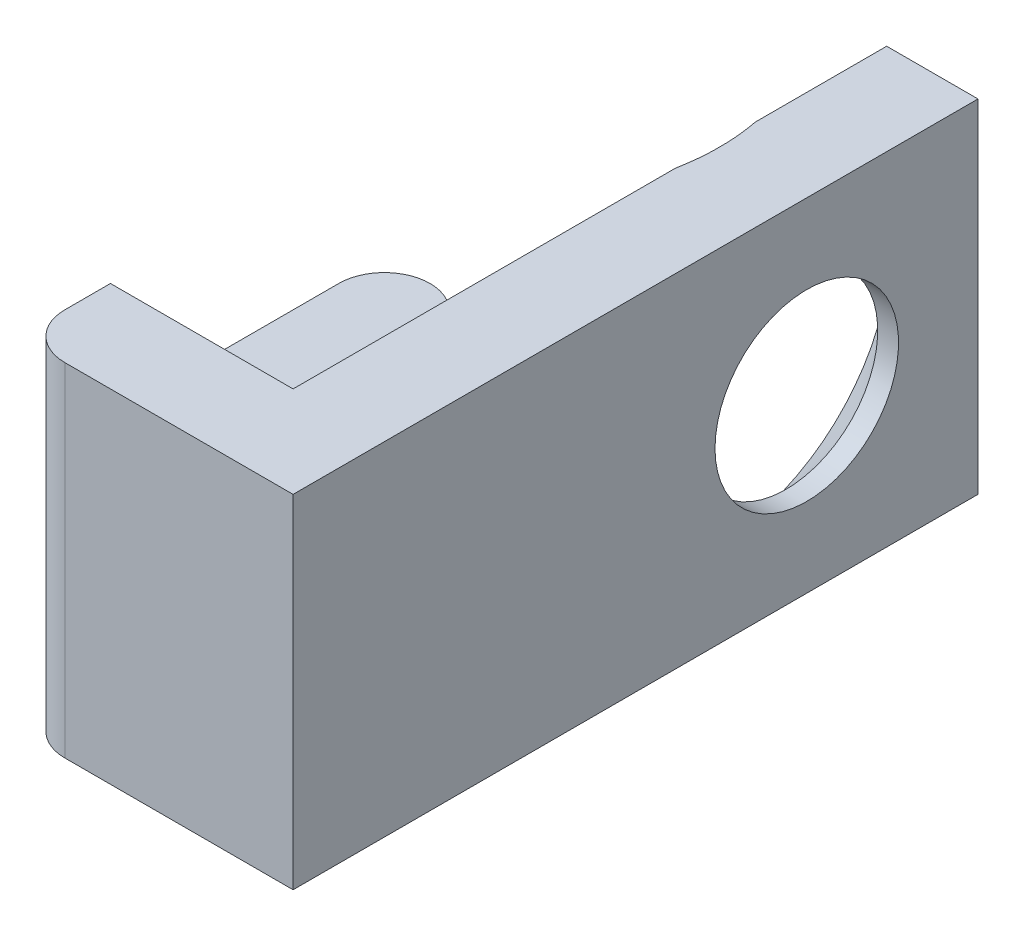
ISO-10303-21;
HEADER;
FILE_DESCRIPTION(('STEP AP214'),'2;1');
FILE_NAME('part.step','',(''),(''),'','','');
FILE_SCHEMA(('AUTOMOTIVE_DESIGN { 1 0 10303 214 1 1 1 1 }'));
ENDSEC;
DATA;
#1=APPLICATION_CONTEXT('core data for automotive mechanical design processes');
#2=APPLICATION_PROTOCOL_DEFINITION('international standard','automotive_design',2000,#1);
#3=PRODUCT_CONTEXT('',#1,'mechanical');
#4=PRODUCT('Part','Part','',(#3));
#5=PRODUCT_RELATED_PRODUCT_CATEGORY('part','',(#4));
#6=PRODUCT_DEFINITION_FORMATION('','',#4);
#7=PRODUCT_DEFINITION_CONTEXT('part definition',#1,'design');
#8=PRODUCT_DEFINITION('design','',#6,#7);
#9=PRODUCT_DEFINITION_SHAPE('','',#8);
#10=(LENGTH_UNIT() NAMED_UNIT(*) SI_UNIT(.MILLI.,.METRE.));
#11=(NAMED_UNIT(*) PLANE_ANGLE_UNIT() SI_UNIT($,.RADIAN.));
#12=(NAMED_UNIT(*) SI_UNIT($,.STERADIAN.) SOLID_ANGLE_UNIT());
#13=UNCERTAINTY_MEASURE_WITH_UNIT(LENGTH_MEASURE(1.E-05),#10,'distance_accuracy_value','');
#14=(GEOMETRIC_REPRESENTATION_CONTEXT(3) GLOBAL_UNCERTAINTY_ASSIGNED_CONTEXT((#13)) GLOBAL_UNIT_ASSIGNED_CONTEXT((#10,
#11,#12)) REPRESENTATION_CONTEXT('',''));
#15=CARTESIAN_POINT('',(0.,0.,0.));
#16=DIRECTION('',(0.,0.,1.));
#17=DIRECTION('',(1.,0.,0.));
#18=AXIS2_PLACEMENT_3D('',#15,#16,#17);
#19=CARTESIAN_POINT('',(-6.35,4.7625,0.));
#20=DIRECTION('',(-1.,0.,0.));
#21=DIRECTION('',(0.,0.,1.));
#22=AXIS2_PLACEMENT_3D('',#19,#20,#21);
#23=PLANE('',#22);
#24=DIRECTION('',(0.,0.,-1.));
#25=VECTOR('',#24,1.);
#26=CARTESIAN_POINT('',(-6.35,-1.5875,0.));
#27=LINE('',#26,#25);
#28=CARTESIAN_POINT('',(-6.35,-1.5875,3.81));
#29=VERTEX_POINT('',#28);
#30=CARTESIAN_POINT('',(-6.35,-1.5875,0.634999999999999));
#31=VERTEX_POINT('',#30);
#32=EDGE_CURVE('E151',#29,#31,#27,.T.);
#33=ORIENTED_EDGE('',*,*,#32,.F.);
#34=CARTESIAN_POINT('',(-6.35,-4.7625,3.81));
#35=DIRECTION('',(-1.,0.,0.));
#36=DIRECTION('',(0.,0.,1.));
#37=AXIS2_PLACEMENT_3D('',#34,#35,#36);
#38=CIRCLE('',#37,3.175);
#39=CARTESIAN_POINT('',(-6.35,-4.7625,6.98499999999999));
#40=VERTEX_POINT('',#39);
#41=EDGE_CURVE('E141',#40,#29,#38,.T.);
#42=ORIENTED_EDGE('',*,*,#41,.F.);
#43=DIRECTION('',(0.,0.,-1.));
#44=VECTOR('',#43,1.);
#45=CARTESIAN_POINT('',(-6.35,-4.7625,0.));
#46=LINE('',#45,#44);
#47=CARTESIAN_POINT('',(-6.35,-4.7625,8.255));
#48=VERTEX_POINT('',#47);
#49=EDGE_CURVE('E273',#48,#40,#46,.T.);
#50=ORIENTED_EDGE('',*,*,#49,.F.);
#51=DIRECTION('',(0.,-1.,0.));
#52=VECTOR('',#51,1.);
#53=CARTESIAN_POINT('',(-6.35,4.7625,8.255));
#54=LINE('',#53,#52);
#55=CARTESIAN_POINT('',(-6.35,4.7625,8.255));
#56=VERTEX_POINT('',#55);
#57=EDGE_CURVE('E231',#56,#48,#54,.T.);
#58=ORIENTED_EDGE('',*,*,#57,.F.);
#59=DIRECTION('',(0.,0.,-1.));
#60=VECTOR('',#59,1.);
#61=CARTESIAN_POINT('',(-6.35,4.7625,0.));
#62=LINE('',#61,#60);
#63=CARTESIAN_POINT('',(-6.35,4.7625,6.985));
#64=VERTEX_POINT('',#63);
#65=EDGE_CURVE('E256',#56,#64,#62,.T.);
#66=ORIENTED_EDGE('',*,*,#65,.T.);
#67=CARTESIAN_POINT('',(-6.35,4.7625,3.81));
#68=DIRECTION('',(-1.,0.,0.));
#69=DIRECTION('',(0.,0.,1.));
#70=AXIS2_PLACEMENT_3D('',#67,#68,#69);
#71=CIRCLE('',#70,3.175);
#72=CARTESIAN_POINT('',(-6.35,1.5875,3.81));
#73=VERTEX_POINT('',#72);
#74=EDGE_CURVE('E49',#73,#64,#71,.T.);
#75=ORIENTED_EDGE('',*,*,#74,.F.);
#76=DIRECTION('',(0.,0.,1.));
#77=VECTOR('',#76,1.);
#78=CARTESIAN_POINT('',(-6.35,1.5875,0.));
#79=LINE('',#78,#77);
#80=CARTESIAN_POINT('',(-6.35,1.5875,0.634999999999999));
#81=VERTEX_POINT('',#80);
#82=EDGE_CURVE('E168',#81,#73,#79,.T.);
#83=ORIENTED_EDGE('',*,*,#82,.F.);
#84=DIRECTION('',(0.,-1.,0.));
#85=VECTOR('',#84,1.);
#86=CARTESIAN_POINT('',(-6.35,4.7625,0.634999999999999));
#87=LINE('',#86,#85);
#88=EDGE_CURVE('E164',#81,#31,#87,.T.);
#89=ORIENTED_EDGE('',*,*,#88,.T.);
#90=EDGE_LOOP('',(#33,#42,#50,#58,#66,#75,#83,#89));
#91=FACE_BOUND('',#90,.T.);
#92=ADVANCED_FACE('F35',(#91),#23,.T.);
#93=CARTESIAN_POINT('',(-3.81,4.7625,0.));
#94=DIRECTION('',(-1.,0.,0.));
#95=DIRECTION('',(0.,0.,1.));
#96=AXIS2_PLACEMENT_3D('',#93,#94,#95);
#97=PLANE('',#96);
#98=CARTESIAN_POINT('',(-3.81,-4.7625,3.81));
#99=DIRECTION('',(-1.,0.,0.));
#100=DIRECTION('',(0.,0.,1.));
#101=AXIS2_PLACEMENT_3D('',#98,#99,#100);
#102=CIRCLE('',#101,3.175);
#103=CARTESIAN_POINT('',(-3.81,-1.5875,3.81));
#104=VERTEX_POINT('',#103);
#105=CARTESIAN_POINT('',(-3.81,-4.7625,6.985));
#106=VERTEX_POINT('',#105);
#107=EDGE_CURVE('E178',#104,#106,#102,.F.);
#108=ORIENTED_EDGE('',*,*,#107,.F.);
#109=DIRECTION('',(0.,0.,1.));
#110=VECTOR('',#109,1.);
#111=CARTESIAN_POINT('',(-3.81,-1.5875,0.));
#112=LINE('',#111,#110);
#113=CARTESIAN_POINT('',(-3.81,-1.5875,0.634999999999999));
#114=VERTEX_POINT('',#113);
#115=EDGE_CURVE('E159',#114,#104,#112,.T.);
#116=ORIENTED_EDGE('',*,*,#115,.F.);
#117=DIRECTION('',(0.,-1.,0.));
#118=VECTOR('',#117,1.);
#119=CARTESIAN_POINT('',(-3.81,4.7625,0.634999999999999));
#120=LINE('',#119,#118);
#121=CARTESIAN_POINT('',(-3.81,1.5875,0.634999999999999));
#122=VERTEX_POINT('',#121);
#123=EDGE_CURVE('E248',#122,#114,#120,.T.);
#124=ORIENTED_EDGE('',*,*,#123,.F.);
#125=DIRECTION('',(0.,0.,-1.));
#126=VECTOR('',#125,1.);
#127=CARTESIAN_POINT('',(-3.81,1.5875,0.));
#128=LINE('',#127,#126);
#129=CARTESIAN_POINT('',(-3.81,1.5875,3.81));
#130=VERTEX_POINT('',#129);
#131=EDGE_CURVE('E173',#130,#122,#128,.T.);
#132=ORIENTED_EDGE('',*,*,#131,.F.);
#133=CARTESIAN_POINT('',(-3.81,4.7625,3.81));
#134=DIRECTION('',(-1.,0.,0.));
#135=DIRECTION('',(0.,0.,1.));
#136=AXIS2_PLACEMENT_3D('',#133,#134,#135);
#137=CIRCLE('',#136,3.175);
#138=CARTESIAN_POINT('',(-3.81,4.7625,6.985));
#139=VERTEX_POINT('',#138);
#140=EDGE_CURVE('E180',#139,#130,#137,.F.);
#141=ORIENTED_EDGE('',*,*,#140,.F.);
#142=DIRECTION('',(0.,-1.,0.));
#143=VECTOR('',#142,1.);
#144=CARTESIAN_POINT('',(-3.81,4.7625,6.985));
#145=LINE('',#144,#143);
#146=EDGE_CURVE('E245',#139,#106,#145,.T.);
#147=ORIENTED_EDGE('',*,*,#146,.T.);
#148=EDGE_LOOP('',(#108,#116,#124,#132,#141,#147));
#149=FACE_BOUND('',#148,.T.);
#150=ADVANCED_FACE('F302',(#149),#97,.F.);
#151=CARTESIAN_POINT('',(-5.08,4.7625,0.634999999999999));
#152=DIRECTION('',(0.,-1.,0.));
#153=DIRECTION('',(0.,0.,-1.));
#154=AXIS2_PLACEMENT_3D('',#151,#152,#153);
#155=CYLINDRICAL_SURFACE('',#154,1.27);
#156=CARTESIAN_POINT('',(-5.08,-1.5875,0.634999999999999));
#157=DIRECTION('',(0.,-1.,0.));
#158=DIRECTION('',(0.,0.,-1.));
#159=AXIS2_PLACEMENT_3D('',#156,#157,#158);
#160=CIRCLE('',#159,1.27);
#161=EDGE_CURVE('E175',#31,#114,#160,.T.);
#162=ORIENTED_EDGE('',*,*,#161,.F.);
#163=ORIENTED_EDGE('',*,*,#88,.F.);
#164=CARTESIAN_POINT('',(-5.08,1.5875,0.634999999999999));
#165=DIRECTION('',(0.,1.,0.));
#166=DIRECTION('',(0.,0.,1.));
#167=AXIS2_PLACEMENT_3D('',#164,#165,#166);
#168=CIRCLE('',#167,1.27);
#169=EDGE_CURVE('E160',#122,#81,#168,.T.);
#170=ORIENTED_EDGE('',*,*,#169,.F.);
#171=ORIENTED_EDGE('',*,*,#123,.T.);
#172=EDGE_LOOP('',(#162,#163,#170,#171));
#173=FACE_BOUND('',#172,.T.);
#174=ADVANCED_FACE('F215',(#173),#155,.T.);
#175=CARTESIAN_POINT('',(0.,4.7625,0.));
#176=DIRECTION('',(0.,1.,0.));
#177=DIRECTION('',(0.,0.,1.));
#178=AXIS2_PLACEMENT_3D('',#175,#176,#177);
#179=PLANE('',#178);
#180=DIRECTION('',(-1.,0.,0.));
#181=VECTOR('',#180,1.);
#182=CARTESIAN_POINT('',(0.,4.7625,6.985));
#183=LINE('',#182,#181);
#184=CARTESIAN_POINT('',(-1.27,4.7625,6.985));
#185=VERTEX_POINT('',#184);
#186=EDGE_CURVE('E252',#185,#139,#183,.T.);
#187=ORIENTED_EDGE('',*,*,#186,.T.);
#188=DIRECTION('',(1.,0.,0.));
#189=VECTOR('',#188,1.);
#190=CARTESIAN_POINT('',(-6.35,4.7625,6.985));
#191=LINE('',#190,#189);
#192=EDGE_CURVE('E11',#139,#64,#191,.F.);
#193=ORIENTED_EDGE('',*,*,#192,.T.);
#194=ORIENTED_EDGE('',*,*,#65,.F.);
#195=CARTESIAN_POINT('',(-5.08,4.7625,8.255));
#196=DIRECTION('',(0.,1.,0.));
#197=DIRECTION('',(0.,0.,1.));
#198=AXIS2_PLACEMENT_3D('',#195,#196,#197);
#199=CIRCLE('',#198,1.27);
#200=CARTESIAN_POINT('',(-5.08,4.7625,9.525));
#201=VERTEX_POINT('',#200);
#202=EDGE_CURVE('E289',#56,#201,#199,.T.);
#203=ORIENTED_EDGE('',*,*,#202,.T.);
#204=DIRECTION('',(-1.,0.,0.));
#205=VECTOR('',#204,1.);
#206=CARTESIAN_POINT('',(0.,4.7625,9.525));
#207=LINE('',#206,#205);
#208=CARTESIAN_POINT('',(1.27,4.7625,9.525));
#209=VERTEX_POINT('',#208);
#210=EDGE_CURVE('E286',#209,#201,#207,.T.);
#211=ORIENTED_EDGE('',*,*,#210,.F.);
#212=DIRECTION('',(0.,0.,-1.));
#213=VECTOR('',#212,1.);
#214=CARTESIAN_POINT('',(1.27,4.7625,0.));
#215=LINE('',#214,#213);
#216=CARTESIAN_POINT('',(1.27,4.7625,-9.525));
#217=VERTEX_POINT('',#216);
#218=EDGE_CURVE('E284',#209,#217,#215,.T.);
#219=ORIENTED_EDGE('',*,*,#218,.T.);
#220=DIRECTION('',(1.,0.,0.));
#221=VECTOR('',#220,1.);
#222=CARTESIAN_POINT('',(0.,4.7625,-9.525));
#223=LINE('',#222,#221);
#224=CARTESIAN_POINT('',(-1.27,4.7625,-9.525));
#225=VERTEX_POINT('',#224);
#226=EDGE_CURVE('E281',#225,#217,#223,.T.);
#227=ORIENTED_EDGE('',*,*,#226,.F.);
#228=DIRECTION('',(0.,0.,-1.));
#229=VECTOR('',#228,1.);
#230=CARTESIAN_POINT('',(-1.27,4.7625,0.));
#231=LINE('',#230,#229);
#232=CARTESIAN_POINT('',(-1.27,4.7625,-5.86966033165933));
#233=VERTEX_POINT('',#232);
#234=EDGE_CURVE('E280',#233,#225,#231,.T.);
#235=ORIENTED_EDGE('',*,*,#234,.F.);
#236=CARTESIAN_POINT('',(-5.62698198970123,4.7625,-13.6486852423024));
#237=CARTESIAN_POINT('',(-5.48405181043274,4.7625,-13.4554022025235));
#238=CARTESIAN_POINT('',(-5.34177027240464,4.7625,-13.261635486537));
#239=CARTESIAN_POINT('',(-5.05881023652339,4.7625,-12.87291597153));
#240=CARTESIAN_POINT('',(-4.91813184619668,4.7625,-12.6779630942807));
#241=CARTESIAN_POINT('',(-4.63837640303074,4.7625,-12.2862209008152));
#242=CARTESIAN_POINT('',(-4.49930386235509,4.7625,-12.08942835697));
#243=CARTESIAN_POINT('',(-4.22353144435932,4.7625,-11.6941920870384));
#244=CARTESIAN_POINT('',(-4.08683151221835,4.7625,-11.49574839926));
#245=CARTESIAN_POINT('',(-3.81014565709836,4.7625,-11.087709994364));
#246=CARTESIAN_POINT('',(-3.67029725258007,4.7625,-10.8780217911883));
#247=CARTESIAN_POINT('',(-3.39466094259247,4.7625,-10.4559954922825));
#248=CARTESIAN_POINT('',(-3.2588728940184,4.7625,-10.2436574903177));
#249=CARTESIAN_POINT('',(-2.99263886077864,4.7625,-9.8159080888331));
#250=CARTESIAN_POINT('',(-2.86218819856629,4.7625,-9.60049961359343));
#251=CARTESIAN_POINT('',(-2.60813506619638,4.7625,-9.16569848540146));
#252=CARTESIAN_POINT('',(-2.48453160975527,4.7625,-8.94630641233006));
#253=CARTESIAN_POINT('',(-2.24478535240492,4.7625,-8.49955565581558));
#254=CARTESIAN_POINT('',(-2.12876814798659,4.7625,-8.27212897398496));
#255=CARTESIAN_POINT('',(-1.90935858859765,4.7625,-7.81104716494044));
#256=CARTESIAN_POINT('',(-1.80597219322786,4.7625,-7.57738916045719));
#257=CARTESIAN_POINT('',(-1.61758040331887,4.7625,-7.10572150369547));
#258=CARTESIAN_POINT('',(-1.53238097455184,4.7625,-6.86779057911233));
#259=CARTESIAN_POINT('',(-1.38480361925059,4.7625,-6.38505263199183));
#260=CARTESIAN_POINT('',(-1.32239315527715,4.7625,-6.14025595456541));
#261=CARTESIAN_POINT('',(-1.25282511829775,4.7625,-5.78125818246457));
#262=CARTESIAN_POINT('',(-1.23415415302169,4.7625,-5.66924459439971));
#263=CARTESIAN_POINT('',(-1.20309477945248,4.7625,-5.44423157526996));
#264=CARTESIAN_POINT('',(-1.19071243901943,4.7625,-5.33123129866222));
#265=CARTESIAN_POINT('',(-1.16869712968132,4.7625,-5.05553291027898));
#266=CARTESIAN_POINT('',(-1.16258624535323,4.7625,-4.89253792353511));
#267=CARTESIAN_POINT('',(-1.16447359624844,4.7625,-4.56658583975173));
#268=CARTESIAN_POINT('',(-1.17247673413935,4.7625,-4.40362877555097));
#269=CARTESIAN_POINT('',(-1.20213539760851,4.7625,-4.07870525763733));
#270=CARTESIAN_POINT('',(-1.22381361625543,4.7625,-3.91674090324772));
#271=CARTESIAN_POINT('',(-1.2796360783885,4.7625,-3.59500618312683));
#272=CARTESIAN_POINT('',(-1.31378129683157,4.7625,-3.4352359899998));
#273=CARTESIAN_POINT('',(-1.41921824852125,4.7625,-3.01329133618839));
#274=CARTESIAN_POINT('',(-1.50012384032314,4.7625,-2.75352142821305));
#275=CARTESIAN_POINT('',(-1.68438394329689,4.7625,-2.24206612171954));
#276=CARTESIAN_POINT('',(-1.78775985341801,4.7625,-1.99038869391853));
#277=CARTESIAN_POINT('',(-1.95560415867418,4.7625,-1.6169148934159));
#278=CARTESIAN_POINT('',(-2.01407369633418,4.7625,-1.49236009071142));
#279=CARTESIAN_POINT('',(-2.1345430727819,4.7625,-1.24496423573852));
#280=CARTESIAN_POINT('',(-2.19654295939915,4.7625,-1.12212320671656));
#281=CARTESIAN_POINT('',(-2.32349707110234,4.7625,-0.878058265791833));
#282=CARTESIAN_POINT('',(-2.38844988827291,4.7625,-0.756833618148688));
#283=CARTESIAN_POINT('',(-2.52089293725942,4.7625,-0.515788704648179));
#284=CARTESIAN_POINT('',(-2.58838305421762,4.7625,-0.395968375541849));
#285=CARTESIAN_POINT('',(-2.74356164138738,4.7625,-0.126239517105304));
#286=CARTESIAN_POINT('',(-2.83189545136506,4.7625,0.0232973633632844));
#287=CARTESIAN_POINT('',(-3.01142585785314,4.7625,0.320645687364755));
#288=CARTESIAN_POINT('',(-3.10262258595299,4.7625,0.46845705115739));
#289=CARTESIAN_POINT('',(-3.37979909692249,4.7625,0.909708657485873));
#290=CARTESIAN_POINT('',(-3.56933520410123,4.7625,1.2009150502478));
#291=CARTESIAN_POINT('',(-3.9552531746,4.7625,1.77904180766329));
#292=CARTESIAN_POINT('',(-4.15164017016247,4.7625,2.0659587186376));
#293=CARTESIAN_POINT('',(-4.54933148040171,4.7625,2.63631602475295));
#294=CARTESIAN_POINT('',(-4.75063533442816,4.7625,2.9197567418624));
#295=CARTESIAN_POINT('',(-5.15756712088544,4.7625,3.4848072655965));
#296=CARTESIAN_POINT('',(-5.36320625275508,4.7625,3.76640898431573));
#297=CARTESIAN_POINT('',(-5.77736481023725,4.7625,4.32749168311601));
#298=CARTESIAN_POINT('',(-5.98588429396599,4.7625,4.60697262022975));
#299=CARTESIAN_POINT('',(-6.4050887655197,4.7625,5.1641107257231));
#300=CARTESIAN_POINT('',(-6.61577275905452,4.7625,5.44176864319153));
#301=CARTESIAN_POINT('',(-7.03894684204349,4.7625,5.99570552027054));
#302=CARTESIAN_POINT('',(-7.25143694064792,4.7625,6.27198447288359));
#303=CARTESIAN_POINT('',(-7.84189180322821,4.7625,7.03551206601694));
#304=CARTESIAN_POINT('',(-8.22140711635939,4.7625,7.52156128126648));
#305=CARTESIAN_POINT('',(-8.98372114767731,4.7625,8.49117286270808));
#306=CARTESIAN_POINT('',(-9.36652027825423,4.7625,8.97473490398656));
#307=CARTESIAN_POINT('',(-10.1323342488149,4.7625,9.93723096070064));
#308=CARTESIAN_POINT('',(-10.5153356402058,4.7625,10.4161756861426));
#309=CARTESIAN_POINT('',(-11.2831073564794,4.7625,11.372529504489));
#310=CARTESIAN_POINT('',(-11.6678774119547,4.7625,11.8499388135956));
#311=CARTESIAN_POINT('',(-12.0532933052755,4.7625,12.3268225876999));
#312=B_SPLINE_CURVE_WITH_KNOTS('',3,(#236,#237,#238,#239,#240,#241,#242,#243,#244,#245,#246,
#247,#248,#249,#250,#251,#252,#253,#254,#255,#256,#257,#258,#259,#260,#261,#262,#263,#264,#265,
#266,#267,#268,#269,#270,#271,#272,#273,#274,#275,#276,#277,#278,#279,#280,#281,#282,#283,#284,
#285,#286,#287,#288,#289,#290,#291,#292,#293,#294,#295,#296,#297,#298,#299,#300,#301,#302,#303,
#304,#305,#306,#307,#308,#309,#310,#311),.UNSPECIFIED.,.F.,.F.,(4,2,2,2,2,2,2,2,2,2,2,2,2,2,2,2,
2,2,2,2,2,2,2,2,2,2,2,2,2,2,2,2,2,2,2,2,2,4),(0.,0.721173556627895,1.44239520249632,
2.16530282645291,2.88819372480881,3.64429219766824,4.40036399081446,5.1557583332225,
5.9110435828587,6.67668921501423,7.44269471825649,8.20006677850676,8.95635321655771,
9.29687807866844,9.63773089008886,10.1264271621834,10.6152932219743,11.1049726707701,
11.5946904221786,12.4093975128991,13.224883892066,13.6376267337424,14.0503751686321,
14.4629288335209,14.875463845484,15.3964578930329,15.9174759224032,16.9596903412745,
18.0027030335387,19.0456183800991,20.091675514682,21.1377537862388,22.1833712939712,
23.2289941022834,25.0789672057981,26.9291761376476,28.768927344376,30.6084070342245),.UNSPECIFIED.);
#313=CARTESIAN_POINT('',(-1.27,4.7625,-3.65533966834068));
#314=VERTEX_POINT('',#313);
#315=EDGE_CURVE('E191',#314,#233,#312,.F.);
#316=ORIENTED_EDGE('',*,*,#315,.F.);
#317=EDGE_CURVE('E277',#185,#314,#231,.T.);
#318=ORIENTED_EDGE('',*,*,#317,.F.);
#319=EDGE_LOOP('',(#187,#193,#194,#203,#211,#219,#227,#235,#316,#318));
#320=FACE_BOUND('',#319,.T.);
#321=ADVANCED_FACE('F210',(#320),#179,.T.);
#322=CARTESIAN_POINT('',(0.,-4.7625,0.));
#323=DIRECTION('',(0.,1.,0.));
#324=DIRECTION('',(0.,0.,1.));
#325=AXIS2_PLACEMENT_3D('',#322,#323,#324);
#326=PLANE('',#325);
#327=DIRECTION('',(1.,0.,0.));
#328=VECTOR('',#327,1.);
#329=CARTESIAN_POINT('',(-6.35,-4.7625,6.98499999999999));
#330=LINE('',#329,#328);
#331=EDGE_CURVE('E42',#106,#40,#330,.F.);
#332=ORIENTED_EDGE('',*,*,#331,.F.);
#333=DIRECTION('',(-1.,0.,0.));
#334=VECTOR('',#333,1.);
#335=CARTESIAN_POINT('',(0.,-4.7625,6.985));
#336=LINE('',#335,#334);
#337=CARTESIAN_POINT('',(-1.27,-4.7625,6.985));
#338=VERTEX_POINT('',#337);
#339=EDGE_CURVE('E253',#338,#106,#336,.T.);
#340=ORIENTED_EDGE('',*,*,#339,.F.);
#341=DIRECTION('',(0.,0.,-1.));
#342=VECTOR('',#341,1.);
#343=CARTESIAN_POINT('',(-1.27,-4.7625,0.));
#344=LINE('',#343,#342);
#345=CARTESIAN_POINT('',(-1.27,-4.7625,-3.65533966834068));
#346=VERTEX_POINT('',#345);
#347=EDGE_CURVE('E257',#338,#346,#344,.T.);
#348=ORIENTED_EDGE('',*,*,#347,.T.);
#349=CARTESIAN_POINT('',(-5.62698198970123,-4.7625,-13.6486852423024));
#350=CARTESIAN_POINT('',(-5.48405181043274,-4.7625,-13.4554022025235));
#351=CARTESIAN_POINT('',(-5.34177027240464,-4.7625,-13.261635486537));
#352=CARTESIAN_POINT('',(-5.05881023652339,-4.7625,-12.87291597153));
#353=CARTESIAN_POINT('',(-4.91813184619668,-4.7625,-12.6779630942807));
#354=CARTESIAN_POINT('',(-4.63837640303074,-4.7625,-12.2862209008152));
#355=CARTESIAN_POINT('',(-4.49930386235509,-4.7625,-12.08942835697));
#356=CARTESIAN_POINT('',(-4.22353144435932,-4.7625,-11.6941920870384));
#357=CARTESIAN_POINT('',(-4.08683151221835,-4.7625,-11.49574839926));
#358=CARTESIAN_POINT('',(-3.81014565709836,-4.7625,-11.087709994364));
#359=CARTESIAN_POINT('',(-3.67029725258007,-4.7625,-10.8780217911883));
#360=CARTESIAN_POINT('',(-3.39466094259247,-4.7625,-10.4559954922825));
#361=CARTESIAN_POINT('',(-3.2588728940184,-4.7625,-10.2436574903177));
#362=CARTESIAN_POINT('',(-2.99263886077864,-4.7625,-9.8159080888331));
#363=CARTESIAN_POINT('',(-2.86218819856629,-4.7625,-9.60049961359343));
#364=CARTESIAN_POINT('',(-2.60813506619638,-4.7625,-9.16569848540146));
#365=CARTESIAN_POINT('',(-2.48453160975527,-4.7625,-8.94630641233006));
#366=CARTESIAN_POINT('',(-2.24478535240492,-4.7625,-8.49955565581558));
#367=CARTESIAN_POINT('',(-2.12876814798659,-4.7625,-8.27212897398496));
#368=CARTESIAN_POINT('',(-1.90935858859765,-4.7625,-7.81104716494044));
#369=CARTESIAN_POINT('',(-1.80597219322786,-4.7625,-7.57738916045719));
#370=CARTESIAN_POINT('',(-1.61758040331887,-4.7625,-7.10572150369547));
#371=CARTESIAN_POINT('',(-1.53238097455184,-4.7625,-6.86779057911233));
#372=CARTESIAN_POINT('',(-1.38480361925059,-4.7625,-6.38505263199183));
#373=CARTESIAN_POINT('',(-1.32239315527715,-4.7625,-6.14025595456541));
#374=CARTESIAN_POINT('',(-1.25282511829775,-4.7625,-5.78125818246457));
#375=CARTESIAN_POINT('',(-1.23415415302169,-4.7625,-5.66924459439971));
#376=CARTESIAN_POINT('',(-1.20309477945248,-4.7625,-5.44423157526996));
#377=CARTESIAN_POINT('',(-1.19071243901943,-4.7625,-5.33123129866222));
#378=CARTESIAN_POINT('',(-1.16869712968132,-4.7625,-5.05553291027898));
#379=CARTESIAN_POINT('',(-1.16258624535323,-4.7625,-4.89253792353511));
#380=CARTESIAN_POINT('',(-1.16447359624844,-4.7625,-4.56658583975173));
#381=CARTESIAN_POINT('',(-1.17247673413935,-4.7625,-4.40362877555097));
#382=CARTESIAN_POINT('',(-1.20213539760851,-4.7625,-4.07870525763733));
#383=CARTESIAN_POINT('',(-1.22381361625543,-4.7625,-3.91674090324772));
#384=CARTESIAN_POINT('',(-1.2796360783885,-4.7625,-3.59500618312683));
#385=CARTESIAN_POINT('',(-1.31378129683157,-4.7625,-3.4352359899998));
#386=CARTESIAN_POINT('',(-1.41921824852125,-4.7625,-3.01329133618839));
#387=CARTESIAN_POINT('',(-1.50012384032314,-4.7625,-2.75352142821305));
#388=CARTESIAN_POINT('',(-1.68438394329689,-4.7625,-2.24206612171954));
#389=CARTESIAN_POINT('',(-1.78775985341801,-4.7625,-1.99038869391853));
#390=CARTESIAN_POINT('',(-1.95560415867418,-4.7625,-1.6169148934159));
#391=CARTESIAN_POINT('',(-2.01407369633418,-4.7625,-1.49236009071142));
#392=CARTESIAN_POINT('',(-2.1345430727819,-4.7625,-1.24496423573852));
#393=CARTESIAN_POINT('',(-2.19654295939915,-4.7625,-1.12212320671656));
#394=CARTESIAN_POINT('',(-2.32349707110234,-4.7625,-0.878058265791833));
#395=CARTESIAN_POINT('',(-2.38844988827291,-4.7625,-0.756833618148688));
#396=CARTESIAN_POINT('',(-2.52089293725942,-4.7625,-0.515788704648179));
#397=CARTESIAN_POINT('',(-2.58838305421762,-4.7625,-0.395968375541849));
#398=CARTESIAN_POINT('',(-2.74356164138738,-4.7625,-0.126239517105304));
#399=CARTESIAN_POINT('',(-2.83189545136506,-4.7625,0.0232973633632844));
#400=CARTESIAN_POINT('',(-3.01142585785314,-4.7625,0.320645687364755));
#401=CARTESIAN_POINT('',(-3.10262258595299,-4.7625,0.46845705115739));
#402=CARTESIAN_POINT('',(-3.37979909692249,-4.7625,0.909708657485873));
#403=CARTESIAN_POINT('',(-3.56933520410123,-4.7625,1.2009150502478));
#404=CARTESIAN_POINT('',(-3.9552531746,-4.7625,1.77904180766329));
#405=CARTESIAN_POINT('',(-4.15164017016247,-4.7625,2.0659587186376));
#406=CARTESIAN_POINT('',(-4.54933148040171,-4.7625,2.63631602475295));
#407=CARTESIAN_POINT('',(-4.75063533442816,-4.7625,2.9197567418624));
#408=CARTESIAN_POINT('',(-5.15756712088544,-4.7625,3.4848072655965));
#409=CARTESIAN_POINT('',(-5.36320625275508,-4.7625,3.76640898431573));
#410=CARTESIAN_POINT('',(-5.77736481023725,-4.7625,4.32749168311601));
#411=CARTESIAN_POINT('',(-5.98588429396599,-4.7625,4.60697262022975));
#412=CARTESIAN_POINT('',(-6.4050887655197,-4.7625,5.1641107257231));
#413=CARTESIAN_POINT('',(-6.61577275905452,-4.7625,5.44176864319153));
#414=CARTESIAN_POINT('',(-7.03894684204349,-4.7625,5.99570552027054));
#415=CARTESIAN_POINT('',(-7.25143694064792,-4.7625,6.27198447288359));
#416=CARTESIAN_POINT('',(-7.84189180322821,-4.7625,7.03551206601694));
#417=CARTESIAN_POINT('',(-8.22140711635939,-4.7625,7.52156128126648));
#418=CARTESIAN_POINT('',(-8.98372114767731,-4.7625,8.49117286270808));
#419=CARTESIAN_POINT('',(-9.36652027825423,-4.7625,8.97473490398656));
#420=CARTESIAN_POINT('',(-10.1323342488149,-4.7625,9.93723096070064));
#421=CARTESIAN_POINT('',(-10.5153356402058,-4.7625,10.4161756861426));
#422=CARTESIAN_POINT('',(-11.2831073564794,-4.7625,11.372529504489));
#423=CARTESIAN_POINT('',(-11.6678774119547,-4.7625,11.8499388135956));
#424=CARTESIAN_POINT('',(-12.0532933052755,-4.7625,12.3268225876999));
#425=B_SPLINE_CURVE_WITH_KNOTS('',3,(#349,#350,#351,#352,#353,#354,#355,#356,#357,#358,#359,
#360,#361,#362,#363,#364,#365,#366,#367,#368,#369,#370,#371,#372,#373,#374,#375,#376,#377,#378,
#379,#380,#381,#382,#383,#384,#385,#386,#387,#388,#389,#390,#391,#392,#393,#394,#395,#396,#397,
#398,#399,#400,#401,#402,#403,#404,#405,#406,#407,#408,#409,#410,#411,#412,#413,#414,#415,#416,
#417,#418,#419,#420,#421,#422,#423,#424),.UNSPECIFIED.,.F.,.F.,(4,2,2,2,2,2,2,2,2,2,2,2,2,2,2,2,
2,2,2,2,2,2,2,2,2,2,2,2,2,2,2,2,2,2,2,2,2,4),(0.,0.721173556627895,1.44239520249632,
2.16530282645291,2.88819372480881,3.64429219766824,4.40036399081446,5.1557583332225,
5.9110435828587,6.67668921501423,7.44269471825649,8.20006677850676,8.95635321655771,
9.29687807866844,9.63773089008886,10.1264271621834,10.6152932219743,11.1049726707701,
11.5946904221786,12.4093975128991,13.224883892066,13.6376267337424,14.0503751686321,
14.4629288335209,14.875463845484,15.3964578930329,15.9174759224032,16.9596903412745,
18.0027030335387,19.0456183800991,20.091675514682,21.1377537862388,22.1833712939712,
23.2289941022834,25.0789672057981,26.9291761376476,28.768927344376,30.6084070342245),.UNSPECIFIED.);
#426=CARTESIAN_POINT('',(-1.27,-4.7625,-5.86966033165933));
#427=VERTEX_POINT('',#426);
#428=EDGE_CURVE('E225',#346,#427,#425,.F.);
#429=ORIENTED_EDGE('',*,*,#428,.T.);
#430=CARTESIAN_POINT('',(-1.27,-4.7625,-9.525));
#431=VERTEX_POINT('',#430);
#432=EDGE_CURVE('E260',#427,#431,#344,.T.);
#433=ORIENTED_EDGE('',*,*,#432,.T.);
#434=DIRECTION('',(1.,0.,0.));
#435=VECTOR('',#434,1.);
#436=CARTESIAN_POINT('',(0.,-4.7625,-9.525));
#437=LINE('',#436,#435);
#438=CARTESIAN_POINT('',(1.27,-4.7625,-9.525));
#439=VERTEX_POINT('',#438);
#440=EDGE_CURVE('E261',#431,#439,#437,.T.);
#441=ORIENTED_EDGE('',*,*,#440,.T.);
#442=DIRECTION('',(0.,0.,-1.));
#443=VECTOR('',#442,1.);
#444=CARTESIAN_POINT('',(1.27,-4.7625,0.));
#445=LINE('',#444,#443);
#446=CARTESIAN_POINT('',(1.27,-4.7625,9.525));
#447=VERTEX_POINT('',#446);
#448=EDGE_CURVE('E264',#447,#439,#445,.T.);
#449=ORIENTED_EDGE('',*,*,#448,.F.);
#450=DIRECTION('',(-1.,0.,0.));
#451=VECTOR('',#450,1.);
#452=CARTESIAN_POINT('',(0.,-4.7625,9.525));
#453=LINE('',#452,#451);
#454=CARTESIAN_POINT('',(-5.08,-4.7625,9.525));
#455=VERTEX_POINT('',#454);
#456=EDGE_CURVE('E267',#447,#455,#453,.T.);
#457=ORIENTED_EDGE('',*,*,#456,.T.);
#458=CARTESIAN_POINT('',(-5.08,-4.7625,8.255));
#459=DIRECTION('',(0.,1.,0.));
#460=DIRECTION('',(0.,0.,1.));
#461=AXIS2_PLACEMENT_3D('',#458,#459,#460);
#462=CIRCLE('',#461,1.27);
#463=EDGE_CURVE('E270',#48,#455,#462,.T.);
#464=ORIENTED_EDGE('',*,*,#463,.F.);
#465=ORIENTED_EDGE('',*,*,#49,.T.);
#466=EDGE_LOOP('',(#332,#340,#348,#429,#433,#441,#449,#457,#464,#465));
#467=FACE_BOUND('',#466,.T.);
#468=ADVANCED_FACE('F214',(#467),#326,.F.);
#469=CARTESIAN_POINT('',(-1.27,4.7625,0.));
#470=DIRECTION('',(-1.,0.,0.));
#471=DIRECTION('',(0.,0.,1.));
#472=AXIS2_PLACEMENT_3D('',#469,#470,#471);
#473=PLANE('',#472);
#474=CARTESIAN_POINT('',(-1.27,0.,-4.7625));
#475=DIRECTION('',(-1.,0.,0.));
#476=DIRECTION('',(0.,0.,1.));
#477=AXIS2_PLACEMENT_3D('',#474,#475,#476);
#478=CIRCLE('',#477,4.8895);
#479=CARTESIAN_POINT('',(-1.27,1.10716033165934,-9.525));
#480=VERTEX_POINT('',#479);
#481=EDGE_CURVE('E184',#233,#480,#478,.T.);
#482=ORIENTED_EDGE('',*,*,#481,.F.);
#483=ORIENTED_EDGE('',*,*,#234,.T.);
#484=DIRECTION('',(0.,-1.,0.));
#485=VECTOR('',#484,1.);
#486=CARTESIAN_POINT('',(-1.27,4.7625,-9.525));
#487=LINE('',#486,#485);
#488=EDGE_CURVE('E239',#225,#480,#487,.T.);
#489=ORIENTED_EDGE('',*,*,#488,.T.);
#490=EDGE_LOOP('',(#482,#483,#489));
#491=FACE_BOUND('',#490,.T.);
#492=ADVANCED_FACE('F221',(#491),#473,.T.);
#493=CARTESIAN_POINT('',(-1.27,-1.10716033165934,-9.525));
#494=VERTEX_POINT('',#493);
#495=EDGE_CURVE('E56',#494,#427,#478,.T.);
#496=ORIENTED_EDGE('',*,*,#495,.F.);
#497=EDGE_CURVE('E242',#494,#431,#487,.T.);
#498=ORIENTED_EDGE('',*,*,#497,.T.);
#499=ORIENTED_EDGE('',*,*,#432,.F.);
#500=EDGE_LOOP('',(#496,#498,#499));
#501=FACE_BOUND('',#500,.T.);
#502=ADVANCED_FACE('F320',(#501),#473,.T.);
#503=CARTESIAN_POINT('',(-5.08,4.7625,8.255));
#504=DIRECTION('',(0.,-1.,0.));
#505=DIRECTION('',(0.,0.,-1.));
#506=AXIS2_PLACEMENT_3D('',#503,#504,#505);
#507=CYLINDRICAL_SURFACE('',#506,1.27);
#508=ORIENTED_EDGE('',*,*,#463,.T.);
#509=DIRECTION('',(0.,-1.,0.));
#510=VECTOR('',#509,1.);
#511=CARTESIAN_POINT('',(-5.08,4.7625,9.525));
#512=LINE('',#511,#510);
#513=EDGE_CURVE('E233',#201,#455,#512,.T.);
#514=ORIENTED_EDGE('',*,*,#513,.F.);
#515=ORIENTED_EDGE('',*,*,#202,.F.);
#516=ORIENTED_EDGE('',*,*,#57,.T.);
#517=EDGE_LOOP('',(#508,#514,#515,#516));
#518=FACE_BOUND('',#517,.T.);
#519=ADVANCED_FACE('F334',(#518),#507,.T.);
#520=CARTESIAN_POINT('',(0.,4.7625,9.525));
#521=DIRECTION('',(0.,0.,1.));
#522=DIRECTION('',(1.,0.,0.));
#523=AXIS2_PLACEMENT_3D('',#520,#521,#522);
#524=PLANE('',#523);
#525=ORIENTED_EDGE('',*,*,#456,.F.);
#526=DIRECTION('',(0.,-1.,0.));
#527=VECTOR('',#526,1.);
#528=CARTESIAN_POINT('',(1.27,4.7625,9.525));
#529=LINE('',#528,#527);
#530=EDGE_CURVE('E235',#209,#447,#529,.T.);
#531=ORIENTED_EDGE('',*,*,#530,.F.);
#532=ORIENTED_EDGE('',*,*,#210,.T.);
#533=ORIENTED_EDGE('',*,*,#513,.T.);
#534=EDGE_LOOP('',(#525,#531,#532,#533));
#535=FACE_BOUND('',#534,.T.);
#536=ADVANCED_FACE('F331',(#535),#524,.T.);
#537=CARTESIAN_POINT('',(1.27,4.7625,0.));
#538=DIRECTION('',(-1.,0.,0.));
#539=DIRECTION('',(0.,0.,1.));
#540=AXIS2_PLACEMENT_3D('',#537,#538,#539);
#541=PLANE('',#540);
#542=CARTESIAN_POINT('',(1.27,0.,-4.7625));
#543=DIRECTION('',(-1.,0.,0.));
#544=DIRECTION('',(0.,0.,1.));
#545=AXIS2_PLACEMENT_3D('',#542,#543,#544);
#546=CIRCLE('',#545,2.5527);
#547=CARTESIAN_POINT('',(1.27,0.,-2.2098));
#548=VERTEX_POINT('',#547);
#549=EDGE_CURVE('E188',#548,#548,#546,.T.);
#550=ORIENTED_EDGE('',*,*,#549,.T.);
#551=EDGE_LOOP('',(#550));
#552=FACE_BOUND('',#551,.T.);
#553=ORIENTED_EDGE('',*,*,#448,.T.);
#554=DIRECTION('',(0.,-1.,0.));
#555=VECTOR('',#554,1.);
#556=CARTESIAN_POINT('',(1.27,4.7625,-9.525));
#557=LINE('',#556,#555);
#558=EDGE_CURVE('E237',#217,#439,#557,.T.);
#559=ORIENTED_EDGE('',*,*,#558,.F.);
#560=ORIENTED_EDGE('',*,*,#218,.F.);
#561=ORIENTED_EDGE('',*,*,#530,.T.);
#562=EDGE_LOOP('',(#553,#559,#560,#561));
#563=FACE_BOUND('',#562,.T.);
#564=ADVANCED_FACE('F340',(#552,#563),#541,.F.);
#565=CARTESIAN_POINT('',(0.,4.7625,-9.525));
#566=DIRECTION('',(0.,0.,-1.));
#567=DIRECTION('',(-1.,0.,0.));
#568=AXIS2_PLACEMENT_3D('',#565,#566,#567);
#569=PLANE('',#568);
#570=CARTESIAN_POINT('',(-5.81542106286155,-9.14018528500503,-9.525));
#571=CARTESIAN_POINT('',(-5.66667389283663,-8.94026989254495,-9.525));
#572=CARTESIAN_POINT('',(-5.51857271551333,-8.73986989672875,-9.525));
#573=CARTESIAN_POINT('',(-5.22397229992875,-8.33787652584508,-9.525));
#574=CARTESIAN_POINT('',(-5.0774731661704,-8.13628307423384,-9.525));
#575=CARTESIAN_POINT('',(-4.78606613600136,-7.73123185606841,-9.525));
#576=CARTESIAN_POINT('',(-4.64116275714418,-7.52777083414673,-9.525));
#577=CARTESIAN_POINT('',(-4.35374015957749,-7.11917626895364,-9.525));
#578=CARTESIAN_POINT('',(-4.21122088574753,-6.91404276451353,-9.525));
#579=CARTESIAN_POINT('',(-3.92245292770651,-6.49198837433705,-9.525));
#580=CARTESIAN_POINT('',(-3.77634730399791,-6.27496936128449,-9.525));
#581=CARTESIAN_POINT('',(-3.48826080720058,-5.83821280596984,-9.525));
#582=CARTESIAN_POINT('',(-3.3462797903128,-5.61847535886418,-9.525));
#583=CARTESIAN_POINT('',(-3.06777969281561,-5.17582923352033,-9.525));
#584=CARTESIAN_POINT('',(-2.93125577871123,-4.95292360983103,-9.525));
#585=CARTESIAN_POINT('',(-2.66525238069827,-4.50296579835071,-9.525));
#586=CARTESIAN_POINT('',(-2.53577185747068,-4.27591422897355,-9.525));
#587=CARTESIAN_POINT('',(-2.28668177394539,-3.81744315969725,-9.525));
#588=CARTESIAN_POINT('',(-2.16703929840019,-3.58604169772118,-9.525));
#589=CARTESIAN_POINT('',(-1.94046965558393,-3.11686443831657,-9.525));
#590=CARTESIAN_POINT('',(-1.83354882754909,-2.87908553470527,-9.525));
#591=CARTESIAN_POINT('',(-1.63839092288525,-2.39904815915544,-9.525));
#592=CARTESIAN_POINT('',(-1.54995346358724,-2.15687244004878,-9.525));
#593=CARTESIAN_POINT('',(-1.3964056509288,-1.66533776901728,-9.525));
#594=CARTESIAN_POINT('',(-1.33126082860875,-1.41599002620526,-9.525));
#595=CARTESIAN_POINT('',(-1.25923928914471,-1.05445354766479,-9.525));
#596=CARTESIAN_POINT('',(-1.24026462079033,-0.944627599937949,-9.525));
#597=CARTESIAN_POINT('',(-1.20831656451594,-0.72398473676446,-9.525));
#598=CARTESIAN_POINT('',(-1.19534928829873,-0.613166928522292,-9.525));
#599=CARTESIAN_POINT('',(-1.17133004204949,-0.3400372622502,-9.525));
#600=CARTESIAN_POINT('',(-1.16387685652451,-0.177392179690067,-9.525));
#601=CARTESIAN_POINT('',(-1.16302994430043,0.147978635085672,-9.525));
#602=CARTESIAN_POINT('',(-1.16964096317504,0.310704375994955,-9.525));
#603=CARTESIAN_POINT('',(-1.19654601688046,0.635252856753524,-9.525));
#604=CARTESIAN_POINT('',(-1.2168606656603,0.797073865339017,-9.525));
#605=CARTESIAN_POINT('',(-1.27005181847752,1.11860828845477,-9.525));
#606=CARTESIAN_POINT('',(-1.30292935541121,1.27832152857108,-9.525));
#607=CARTESIAN_POINT('',(-1.40412615527351,1.69589135511249,-9.525));
#608=CARTESIAN_POINT('',(-1.48168408574893,1.95150725193625,-9.525));
#609=CARTESIAN_POINT('',(-1.65899986685294,2.45492149174114,-9.525));
#610=CARTESIAN_POINT('',(-1.75877819762991,2.70271238041989,-9.525));
#611=CARTESIAN_POINT('',(-1.92116597323753,3.07047137909752,-9.525));
#612=CARTESIAN_POINT('',(-1.97780094984147,3.19313996367026,-9.525));
#613=CARTESIAN_POINT('',(-2.09459734995763,3.43679199871412,-9.525));
#614=CARTESIAN_POINT('',(-2.15475882094294,3.55777542647279,-9.525));
#615=CARTESIAN_POINT('',(-2.27804120610107,3.79814818822507,-9.525));
#616=CARTESIAN_POINT('',(-2.34116075716985,3.91753822450426,-9.525));
#617=CARTESIAN_POINT('',(-2.46994874566269,4.15492453570023,-9.525));
#618=CARTESIAN_POINT('',(-2.53561706528465,4.27292087470458,-9.525));
#619=CARTESIAN_POINT('',(-2.76977704925235,4.68467443738224,-9.525));
#620=CARTESIAN_POINT('',(-2.94400531406641,4.97517235690371,-9.525));
#621=CARTESIAN_POINT('',(-3.30187064950978,5.55033663341906,-9.525));
#622=CARTESIAN_POINT('',(-3.48551003355198,5.83500153225085,-9.525));
#623=CARTESIAN_POINT('',(-3.85966118457825,6.40008686310959,-9.525));
#624=CARTESIAN_POINT('',(-4.05017826459363,6.68050376544799,-9.525));
#625=CARTESIAN_POINT('',(-4.43614258245032,7.23786991511791,-9.525));
#626=CARTESIAN_POINT('',(-4.6315893494642,7.51481948985671,-9.525));
#627=CARTESIAN_POINT('',(-5.02683480104676,8.06689751354266,-9.525));
#628=CARTESIAN_POINT('',(-5.22664515975714,8.34201758609431,-9.525));
#629=CARTESIAN_POINT('',(-5.62916930072085,8.89013017940783,-9.525));
#630=CARTESIAN_POINT('',(-5.83188314246048,9.16312265640227,-9.525));
#631=CARTESIAN_POINT('',(-6.23949832080925,9.70727414297636,-9.525));
#632=CARTESIAN_POINT('',(-6.4443986233931,9.97843392809372,-9.525));
#633=CARTESIAN_POINT('',(-6.8560251563747,10.5193648272499,-9.525));
#634=CARTESIAN_POINT('',(-7.06275139663546,10.7891359337751,-9.525));
#635=CARTESIAN_POINT('',(-7.63700728629993,11.5342883328472,-9.525));
#636=CARTESIAN_POINT('',(-8.00610303965503,12.0084623517387,-9.525));
#637=CARTESIAN_POINT('',(-8.74761833608729,12.954298829626,-9.525));
#638=CARTESIAN_POINT('',(-9.12003830758423,13.4259609520112,-9.525));
#639=CARTESIAN_POINT('',(-9.86509897932156,14.3645932579576,-9.525));
#640=CARTESIAN_POINT('',(-10.2377254853691,14.8315747189397,-9.525));
#641=CARTESIAN_POINT('',(-10.9847736555228,15.7639833835077,-9.525));
#642=CARTESIAN_POINT('',(-11.3591950376855,16.2294108128995,-9.525));
#643=CARTESIAN_POINT('',(-11.7342728333882,16.6943049014226,-9.525));
#644=B_SPLINE_CURVE_WITH_KNOTS('',3,(#570,#571,#572,#573,#574,#575,#576,#577,#578,#579,#580,
#581,#582,#583,#584,#585,#586,#587,#588,#589,#590,#591,#592,#593,#594,#595,#596,#597,#598,#599,
#600,#601,#602,#603,#604,#605,#606,#607,#608,#609,#610,#611,#612,#613,#614,#615,#616,#617,#618,
#619,#620,#621,#622,#623,#624,#625,#626,#627,#628,#629,#630,#631,#632,#633,#634,#635,#636,#637,
#638,#639,#640,#641,#642,#643),.UNSPECIFIED.,.F.,.F.,(4,2,2,2,2,2,2,2,2,2,2,2,2,2,2,2,2,2,2,2,2,
2,2,2,2,2,2,2,2,2,2,2,2,2,2,2,4),(0.,0.747550713706719,1.49514990346799,2.2444958109907,
2.99382436964265,3.77864258445793,4.56343340469194,5.34751297466774,6.13147653067259,
6.91270032292517,7.69431178536172,8.46695110234355,9.23844227169102,9.57266020607009,
9.90721741896431,10.3950383728774,10.8830239544797,11.3717452395775,11.8605067150408,
12.6603832030423,13.4609999968436,13.8662895480131,14.2715845563784,14.676694603904,
15.0817859498042,16.0976999195495,17.113864827384,18.1308322674642,19.1477029434906,
20.1677458391822,21.1878096633984,22.207410757135,23.2270173617332,25.0296741381623,
26.8325666924922,28.6248503599746,30.4168611587067),.UNSPECIFIED.);
#645=EDGE_CURVE('E199',#480,#494,#644,.F.);
#646=ORIENTED_EDGE('',*,*,#645,.F.);
#647=ORIENTED_EDGE('',*,*,#488,.F.);
#648=ORIENTED_EDGE('',*,*,#226,.T.);
#649=ORIENTED_EDGE('',*,*,#558,.T.);
#650=ORIENTED_EDGE('',*,*,#440,.F.);
#651=ORIENTED_EDGE('',*,*,#497,.F.);
#652=EDGE_LOOP('',(#646,#647,#648,#649,#650,#651));
#653=FACE_BOUND('',#652,.T.);
#654=ADVANCED_FACE('F324',(#653),#569,.T.);
#655=ORIENTED_EDGE('',*,*,#347,.F.);
#656=DIRECTION('',(0.,-1.,0.));
#657=VECTOR('',#656,1.);
#658=CARTESIAN_POINT('',(-1.27,4.7625,6.985));
#659=LINE('',#658,#657);
#660=EDGE_CURVE('E243',#185,#338,#659,.T.);
#661=ORIENTED_EDGE('',*,*,#660,.F.);
#662=ORIENTED_EDGE('',*,*,#317,.T.);
#663=EDGE_CURVE('E182',#346,#314,#478,.T.);
#664=ORIENTED_EDGE('',*,*,#663,.F.);
#665=EDGE_LOOP('',(#655,#661,#662,#664));
#666=FACE_BOUND('',#665,.T.);
#667=ADVANCED_FACE('F314',(#666),#473,.T.);
#668=CARTESIAN_POINT('',(0.,4.7625,6.985));
#669=DIRECTION('',(0.,0.,1.));
#670=DIRECTION('',(1.,0.,0.));
#671=AXIS2_PLACEMENT_3D('',#668,#669,#670);
#672=PLANE('',#671);
#673=ORIENTED_EDGE('',*,*,#339,.T.);
#674=ORIENTED_EDGE('',*,*,#146,.F.);
#675=ORIENTED_EDGE('',*,*,#186,.F.);
#676=ORIENTED_EDGE('',*,*,#660,.T.);
#677=EDGE_LOOP('',(#673,#674,#675,#676));
#678=FACE_BOUND('',#677,.T.);
#679=ADVANCED_FACE('F312',(#678),#672,.F.);
#680=CARTESIAN_POINT('',(-1.27,0.,-4.7625));
#681=DIRECTION('',(-1.,0.,0.));
#682=DIRECTION('',(0.,0.,1.));
#683=AXIS2_PLACEMENT_3D('',#680,#681,#682);
#684=CONICAL_SURFACE('',#683,4.8895,0.872664625997165);
#685=ORIENTED_EDGE('',*,*,#645,.T.);
#686=ORIENTED_EDGE('',*,*,#495,.T.);
#687=ORIENTED_EDGE('',*,*,#428,.F.);
#688=ORIENTED_EDGE('',*,*,#663,.T.);
#689=ORIENTED_EDGE('',*,*,#315,.T.);
#690=ORIENTED_EDGE('',*,*,#481,.T.);
#691=EDGE_LOOP('',(#685,#686,#687,#688,#689,#690));
#692=FACE_BOUND('',#691,.T.);
#693=CARTESIAN_POINT('',(0.690808018135069,0.,-4.7625));
#694=DIRECTION('',(-1.,0.,0.));
#695=DIRECTION('',(0.,0.,1.));
#696=AXIS2_PLACEMENT_3D('',#693,#694,#695);
#697=CIRCLE('',#696,2.5527);
#698=CARTESIAN_POINT('',(0.690808018135069,0.,-2.20980000000001));
#699=VERTEX_POINT('',#698);
#700=EDGE_CURVE('E185',#699,#699,#697,.T.);
#701=ORIENTED_EDGE('',*,*,#700,.F.);
#702=EDGE_LOOP('',(#701));
#703=FACE_BOUND('',#702,.T.);
#704=ADVANCED_FACE('F206',(#692,#703),#684,.F.);
#705=CARTESIAN_POINT('',(-1.27,0.,-4.7625));
#706=DIRECTION('',(-1.,0.,0.));
#707=DIRECTION('',(0.,0.,1.));
#708=AXIS2_PLACEMENT_3D('',#705,#706,#707);
#709=CYLINDRICAL_SURFACE('',#708,2.5527);
#710=ORIENTED_EDGE('',*,*,#549,.F.);
#711=EDGE_LOOP('',(#710));
#712=FACE_BOUND('',#711,.T.);
#713=ORIENTED_EDGE('',*,*,#700,.T.);
#714=EDGE_LOOP('',(#713));
#715=FACE_BOUND('',#714,.T.);
#716=ADVANCED_FACE('F217',(#712,#715),#709,.F.);
#717=CARTESIAN_POINT('',(-6.35,-4.7625,3.81));
#718=DIRECTION('',(1.,0.,0.));
#719=DIRECTION('',(0.,0.,-1.));
#720=AXIS2_PLACEMENT_3D('',#717,#718,#719);
#721=CYLINDRICAL_SURFACE('',#720,3.175);
#722=ORIENTED_EDGE('',*,*,#107,.T.);
#723=ORIENTED_EDGE('',*,*,#331,.T.);
#724=ORIENTED_EDGE('',*,*,#41,.T.);
#725=DIRECTION('',(1.,0.,0.));
#726=VECTOR('',#725,1.);
#727=CARTESIAN_POINT('',(-6.35,-1.5875,3.81));
#728=LINE('',#727,#726);
#729=EDGE_CURVE('E144',#29,#104,#728,.T.);
#730=ORIENTED_EDGE('',*,*,#729,.T.);
#731=EDGE_LOOP('',(#722,#723,#724,#730));
#732=FACE_BOUND('',#731,.T.);
#733=ADVANCED_FACE('F143',(#732),#721,.F.);
#734=CARTESIAN_POINT('',(-6.35,-1.5875,0.));
#735=DIRECTION('',(0.,-1.,0.));
#736=DIRECTION('',(0.,0.,-1.));
#737=AXIS2_PLACEMENT_3D('',#734,#735,#736);
#738=PLANE('',#737);
#739=ORIENTED_EDGE('',*,*,#115,.T.);
#740=ORIENTED_EDGE('',*,*,#729,.F.);
#741=ORIENTED_EDGE('',*,*,#32,.T.);
#742=ORIENTED_EDGE('',*,*,#161,.T.);
#743=EDGE_LOOP('',(#739,#740,#741,#742));
#744=FACE_BOUND('',#743,.T.);
#745=ADVANCED_FACE('F156',(#744),#738,.T.);
#746=CARTESIAN_POINT('',(-6.35,4.7625,3.81));
#747=DIRECTION('',(1.,0.,0.));
#748=DIRECTION('',(0.,0.,-1.));
#749=AXIS2_PLACEMENT_3D('',#746,#747,#748);
#750=CYLINDRICAL_SURFACE('',#749,3.175);
#751=ORIENTED_EDGE('',*,*,#140,.T.);
#752=DIRECTION('',(1.,0.,0.));
#753=VECTOR('',#752,1.);
#754=CARTESIAN_POINT('',(-6.35,1.5875,3.81));
#755=LINE('',#754,#753);
#756=EDGE_CURVE('E152',#73,#130,#755,.T.);
#757=ORIENTED_EDGE('',*,*,#756,.F.);
#758=ORIENTED_EDGE('',*,*,#74,.T.);
#759=ORIENTED_EDGE('',*,*,#192,.F.);
#760=EDGE_LOOP('',(#751,#757,#758,#759));
#761=FACE_BOUND('',#760,.T.);
#762=ADVANCED_FACE('F299',(#761),#750,.F.);
#763=CARTESIAN_POINT('',(-6.35,1.5875,0.));
#764=DIRECTION('',(0.,1.,0.));
#765=DIRECTION('',(0.,0.,1.));
#766=AXIS2_PLACEMENT_3D('',#763,#764,#765);
#767=PLANE('',#766);
#768=ORIENTED_EDGE('',*,*,#131,.T.);
#769=ORIENTED_EDGE('',*,*,#169,.T.);
#770=ORIENTED_EDGE('',*,*,#82,.T.);
#771=ORIENTED_EDGE('',*,*,#756,.T.);
#772=EDGE_LOOP('',(#768,#769,#770,#771));
#773=FACE_BOUND('',#772,.T.);
#774=ADVANCED_FACE('F306',(#773),#767,.T.);
#775=CLOSED_SHELL('',(#92,#150,#174,#321,#468,#492,#502,#519,#536,#564,#654,#667,#679,#704,#716,
#733,#745,#762,#774));
#776=MANIFOLD_SOLID_BREP('B2',#775);
#777=ADVANCED_BREP_SHAPE_REPRESENTATION('',(#18,#776),#14);
#778=SHAPE_DEFINITION_REPRESENTATION(#9,#777);
ENDSEC;
END-ISO-10303-21;
